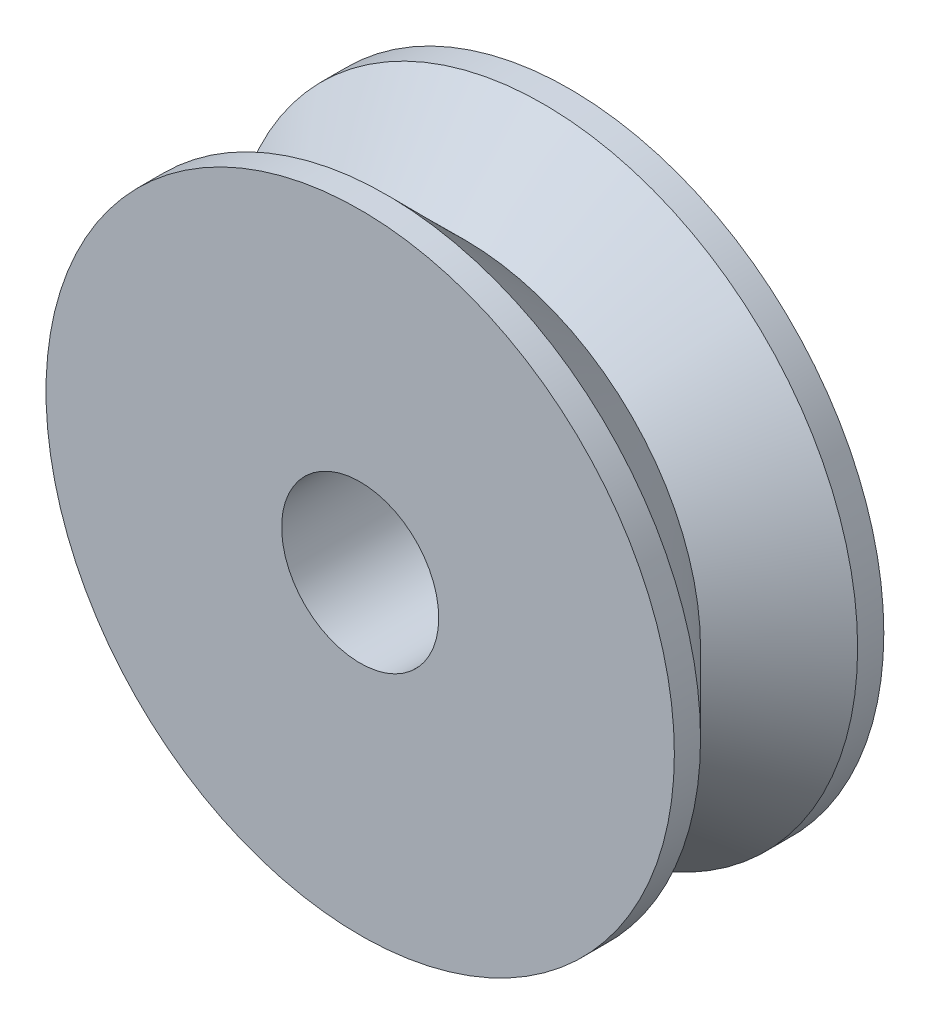
ISO-10303-21;
HEADER;
FILE_DESCRIPTION(('STEP AP214'),'2;1');
FILE_NAME('part.step','',(''),(''),'','','');
FILE_SCHEMA(('AUTOMOTIVE_DESIGN { 1 0 10303 214 1 1 1 1 }'));
ENDSEC;
DATA;
#1=APPLICATION_CONTEXT('core data for automotive mechanical design processes');
#2=APPLICATION_PROTOCOL_DEFINITION('international standard','automotive_design',2000,#1);
#3=PRODUCT_CONTEXT('',#1,'mechanical');
#4=PRODUCT('Part','Part','',(#3));
#5=PRODUCT_RELATED_PRODUCT_CATEGORY('part','',(#4));
#6=PRODUCT_DEFINITION_FORMATION('','',#4);
#7=PRODUCT_DEFINITION_CONTEXT('part definition',#1,'design');
#8=PRODUCT_DEFINITION('design','',#6,#7);
#9=PRODUCT_DEFINITION_SHAPE('','',#8);
#10=(LENGTH_UNIT() NAMED_UNIT(*) SI_UNIT(.MILLI.,.METRE.));
#11=(NAMED_UNIT(*) PLANE_ANGLE_UNIT() SI_UNIT($,.RADIAN.));
#12=(NAMED_UNIT(*) SI_UNIT($,.STERADIAN.) SOLID_ANGLE_UNIT());
#13=UNCERTAINTY_MEASURE_WITH_UNIT(LENGTH_MEASURE(1.E-05),#10,'distance_accuracy_value','');
#14=(GEOMETRIC_REPRESENTATION_CONTEXT(3) GLOBAL_UNCERTAINTY_ASSIGNED_CONTEXT((#13)) GLOBAL_UNIT_ASSIGNED_CONTEXT((#10,
#11,#12)) REPRESENTATION_CONTEXT('',''));
#15=CARTESIAN_POINT('',(0.,0.,0.));
#16=DIRECTION('',(0.,0.,1.));
#17=DIRECTION('',(1.,0.,0.));
#18=AXIS2_PLACEMENT_3D('',#15,#16,#17);
#19=CARTESIAN_POINT('',(0.,0.,0.));
#20=DIRECTION('',(0.,0.,1.));
#21=DIRECTION('',(1.,0.,0.));
#22=AXIS2_PLACEMENT_3D('',#19,#20,#21);
#23=PLANE('',#22);
#24=CARTESIAN_POINT('',(0.,0.,0.));
#25=DIRECTION('',(0.,0.,1.));
#26=DIRECTION('',(1.,0.,0.));
#27=AXIS2_PLACEMENT_3D('',#24,#25,#26);
#28=CIRCLE('',#27,5.99999999999908);
#29=CARTESIAN_POINT('',(5.99999999999908,0.,0.));
#30=VERTEX_POINT('',#29);
#31=EDGE_CURVE('E45',#30,#30,#28,.T.);
#32=ORIENTED_EDGE('',*,*,#31,.F.);
#33=EDGE_LOOP('',(#32));
#34=FACE_BOUND('',#33,.T.);
#35=CARTESIAN_POINT('',(0.,0.,0.));
#36=DIRECTION('',(0.,0.,1.));
#37=DIRECTION('',(1.,0.,0.));
#38=AXIS2_PLACEMENT_3D('',#35,#36,#37);
#39=CIRCLE('',#38,1.49999999999906);
#40=CARTESIAN_POINT('',(1.49999999999906,0.,0.));
#41=VERTEX_POINT('',#40);
#42=EDGE_CURVE('E50',#41,#41,#39,.T.);
#43=ORIENTED_EDGE('',*,*,#42,.T.);
#44=EDGE_LOOP('',(#43));
#45=FACE_BOUND('',#44,.T.);
#46=ADVANCED_FACE('F30',(#34,#45),#23,.F.);
#47=CARTESIAN_POINT('',(0.,0.,2.));
#48=DIRECTION('',(0.,0.,-1.));
#49=DIRECTION('',(-1.,0.,0.));
#50=AXIS2_PLACEMENT_3D('',#47,#48,#49);
#51=CYLINDRICAL_SURFACE('',#50,5.99999999999908);
#52=CARTESIAN_POINT('',(0.,0.,0.499999999999999));
#53=DIRECTION('',(0.,0.,1.));
#54=DIRECTION('',(1.,0.,0.));
#55=AXIS2_PLACEMENT_3D('',#52,#53,#54);
#56=CIRCLE('',#55,5.99999999999908);
#57=CARTESIAN_POINT('',(5.99999999999908,0.,0.499999999999999));
#58=VERTEX_POINT('',#57);
#59=EDGE_CURVE('E37',#58,#58,#56,.F.);
#60=ORIENTED_EDGE('',*,*,#59,.T.);
#61=EDGE_LOOP('',(#60));
#62=FACE_BOUND('',#61,.T.);
#63=ORIENTED_EDGE('',*,*,#31,.T.);
#64=EDGE_LOOP('',(#63));
#65=FACE_BOUND('',#64,.T.);
#66=ADVANCED_FACE('F75',(#62,#65),#51,.T.);
#67=CARTESIAN_POINT('',(0.,0.,2.));
#68=DIRECTION('',(0.,0.,-1.));
#69=DIRECTION('',(-1.,0.,0.));
#70=AXIS2_PLACEMENT_3D('',#67,#68,#69);
#71=CYLINDRICAL_SURFACE('',#70,1.49999999999906);
#72=ORIENTED_EDGE('',*,*,#42,.F.);
#73=EDGE_LOOP('',(#72));
#74=FACE_BOUND('',#73,.T.);
#75=CARTESIAN_POINT('',(0.,0.,4.));
#76=DIRECTION('',(0.,0.,1.));
#77=DIRECTION('',(1.,0.,0.));
#78=AXIS2_PLACEMENT_3D('',#75,#76,#77);
#79=CIRCLE('',#78,1.5);
#80=CARTESIAN_POINT('',(1.5,0.,4.));
#81=VERTEX_POINT('',#80);
#82=EDGE_CURVE('E56',#81,#81,#79,.T.);
#83=ORIENTED_EDGE('',*,*,#82,.T.);
#84=EDGE_LOOP('',(#83));
#85=FACE_BOUND('',#84,.T.);
#86=ADVANCED_FACE('F60',(#74,#85),#71,.F.);
#87=CARTESIAN_POINT('',(0.,0.,2.));
#88=DIRECTION('',(0.,0.,-1.));
#89=DIRECTION('',(-1.,0.,0.));
#90=AXIS2_PLACEMENT_3D('',#87,#88,#89);
#91=CONICAL_SURFACE('',#90,4.49999999999909,0.785398163397447);
#92=ORIENTED_EDGE('',*,*,#59,.F.);
#93=EDGE_LOOP('',(#92));
#94=FACE_BOUND('',#93,.T.);
#95=CARTESIAN_POINT('',(0.,0.,2.));
#96=DIRECTION('',(0.,0.,1.));
#97=DIRECTION('',(1.,0.,0.));
#98=AXIS2_PLACEMENT_3D('',#95,#96,#97);
#99=CIRCLE('',#98,4.49999999999909);
#100=CARTESIAN_POINT('',(4.49999999999909,0.,2.));
#101=VERTEX_POINT('',#100);
#102=EDGE_CURVE('E41',#101,#101,#99,.T.);
#103=ORIENTED_EDGE('',*,*,#102,.F.);
#104=EDGE_LOOP('',(#103));
#105=FACE_BOUND('',#104,.T.);
#106=ADVANCED_FACE('F65',(#94,#105),#91,.T.);
#107=CARTESIAN_POINT('',(0.,0.,4.));
#108=DIRECTION('',(0.,0.,1.));
#109=DIRECTION('',(1.,0.,0.));
#110=AXIS2_PLACEMENT_3D('',#107,#108,#109);
#111=PLANE('',#110);
#112=CARTESIAN_POINT('',(0.,0.,4.));
#113=DIRECTION('',(0.,0.,1.));
#114=DIRECTION('',(1.,0.,0.));
#115=AXIS2_PLACEMENT_3D('',#112,#113,#114);
#116=CIRCLE('',#115,5.99999999999908);
#117=CARTESIAN_POINT('',(5.99999999999908,0.,4.));
#118=VERTEX_POINT('',#117);
#119=EDGE_CURVE('E53',#118,#118,#116,.T.);
#120=ORIENTED_EDGE('',*,*,#119,.T.);
#121=EDGE_LOOP('',(#120));
#122=FACE_BOUND('',#121,.T.);
#123=ORIENTED_EDGE('',*,*,#82,.F.);
#124=EDGE_LOOP('',(#123));
#125=FACE_BOUND('',#124,.T.);
#126=ADVANCED_FACE('F62',(#122,#125),#111,.T.);
#127=CARTESIAN_POINT('',(0.,0.,4.));
#128=DIRECTION('',(0.,0.,-1.));
#129=DIRECTION('',(-1.,0.,0.));
#130=AXIS2_PLACEMENT_3D('',#127,#128,#129);
#131=CYLINDRICAL_SURFACE('',#130,5.99999999999908);
#132=CARTESIAN_POINT('',(0.,0.,3.5));
#133=DIRECTION('',(0.,0.,1.));
#134=DIRECTION('',(1.,0.,0.));
#135=AXIS2_PLACEMENT_3D('',#132,#133,#134);
#136=CIRCLE('',#135,5.99999999999908);
#137=CARTESIAN_POINT('',(5.99999999999908,0.,3.5));
#138=VERTEX_POINT('',#137);
#139=EDGE_CURVE('E10',#138,#138,#136,.T.);
#140=ORIENTED_EDGE('',*,*,#139,.T.);
#141=EDGE_LOOP('',(#140));
#142=FACE_BOUND('',#141,.T.);
#143=ORIENTED_EDGE('',*,*,#119,.F.);
#144=EDGE_LOOP('',(#143));
#145=FACE_BOUND('',#144,.T.);
#146=ADVANCED_FACE('F64',(#142,#145),#131,.T.);
#147=CARTESIAN_POINT('',(0.,0.,3.5));
#148=DIRECTION('',(0.,0.,1.));
#149=DIRECTION('',(1.,0.,0.));
#150=AXIS2_PLACEMENT_3D('',#147,#148,#149);
#151=CONICAL_SURFACE('',#150,5.99999999999908,0.785398163397451);
#152=ORIENTED_EDGE('',*,*,#102,.T.);
#153=EDGE_LOOP('',(#152));
#154=FACE_BOUND('',#153,.T.);
#155=ORIENTED_EDGE('',*,*,#139,.F.);
#156=EDGE_LOOP('',(#155));
#157=FACE_BOUND('',#156,.T.);
#158=ADVANCED_FACE('F32',(#154,#157),#151,.T.);
#159=CLOSED_SHELL('',(#46,#66,#86,#106,#126,#146,#158));
#160=MANIFOLD_SOLID_BREP('B2',#159);
#161=ADVANCED_BREP_SHAPE_REPRESENTATION('',(#18,#160),#14);
#162=SHAPE_DEFINITION_REPRESENTATION(#9,#161);
ENDSEC;
END-ISO-10303-21;
